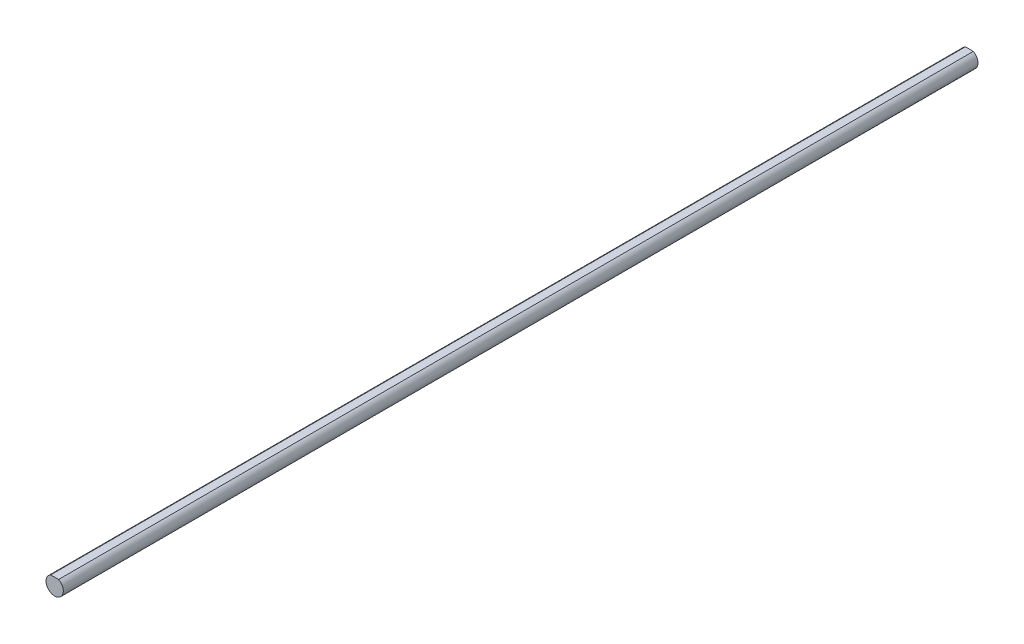
ISO-10303-21;
HEADER;
FILE_DESCRIPTION(('STEP AP214'),'2;1');
FILE_NAME('part.step','',(''),(''),'','','');
FILE_SCHEMA(('AUTOMOTIVE_DESIGN { 1 0 10303 214 1 1 1 1 }'));
ENDSEC;
DATA;
#1=APPLICATION_CONTEXT('core data for automotive mechanical design processes');
#2=APPLICATION_PROTOCOL_DEFINITION('international standard','automotive_design',2000,#1);
#3=PRODUCT_CONTEXT('',#1,'mechanical');
#4=PRODUCT('Part','Part','',(#3));
#5=PRODUCT_RELATED_PRODUCT_CATEGORY('part','',(#4));
#6=PRODUCT_DEFINITION_FORMATION('','',#4);
#7=PRODUCT_DEFINITION_CONTEXT('part definition',#1,'design');
#8=PRODUCT_DEFINITION('design','',#6,#7);
#9=PRODUCT_DEFINITION_SHAPE('','',#8);
#10=(LENGTH_UNIT() NAMED_UNIT(*) SI_UNIT(.MILLI.,.METRE.));
#11=(NAMED_UNIT(*) PLANE_ANGLE_UNIT() SI_UNIT($,.RADIAN.));
#12=(NAMED_UNIT(*) SI_UNIT($,.STERADIAN.) SOLID_ANGLE_UNIT());
#13=UNCERTAINTY_MEASURE_WITH_UNIT(LENGTH_MEASURE(1.E-05),#10,'distance_accuracy_value','');
#14=(GEOMETRIC_REPRESENTATION_CONTEXT(3) GLOBAL_UNCERTAINTY_ASSIGNED_CONTEXT((#13)) GLOBAL_UNIT_ASSIGNED_CONTEXT((#10,
#11,#12)) REPRESENTATION_CONTEXT('',''));
#15=CARTESIAN_POINT('',(0.,0.,0.));
#16=DIRECTION('',(0.,0.,1.));
#17=DIRECTION('',(1.,0.,0.));
#18=AXIS2_PLACEMENT_3D('',#15,#16,#17);
#19=CARTESIAN_POINT('',(0.,0.,125.));
#20=DIRECTION('',(0.,0.,-1.));
#21=DIRECTION('',(-1.,0.,0.));
#22=AXIS2_PLACEMENT_3D('',#19,#20,#21);
#23=CYLINDRICAL_SURFACE('',#22,2.365);
#24=CARTESIAN_POINT('',(0.,0.,-125.));
#25=DIRECTION('',(0.,0.,-1.));
#26=DIRECTION('',(-1.,0.,0.));
#27=AXIS2_PLACEMENT_3D('',#24,#25,#26);
#28=CIRCLE('',#27,2.365);
#29=CARTESIAN_POINT('',(1.0877614628217,2.1,-125.));
#30=VERTEX_POINT('',#29);
#31=CARTESIAN_POINT('',(-1.0877614628217,2.1,-125.));
#32=VERTEX_POINT('',#31);
#33=EDGE_CURVE('E62',#30,#32,#28,.T.);
#34=ORIENTED_EDGE('',*,*,#33,.F.);
#35=DIRECTION('',(0.,0.,-1.));
#36=VECTOR('',#35,1.);
#37=CARTESIAN_POINT('',(1.0877614628217,2.1,125.));
#38=LINE('',#37,#36);
#39=CARTESIAN_POINT('',(1.0877614628217,2.1,125.));
#40=VERTEX_POINT('',#39);
#41=EDGE_CURVE('E11',#40,#30,#38,.T.);
#42=ORIENTED_EDGE('',*,*,#41,.F.);
#43=CARTESIAN_POINT('',(0.,0.,125.));
#44=DIRECTION('',(0.,0.,-1.));
#45=DIRECTION('',(-1.,0.,0.));
#46=AXIS2_PLACEMENT_3D('',#43,#44,#45);
#47=CIRCLE('',#46,2.365);
#48=CARTESIAN_POINT('',(-1.0877614628217,2.1,125.));
#49=VERTEX_POINT('',#48);
#50=EDGE_CURVE('E66',#40,#49,#47,.T.);
#51=ORIENTED_EDGE('',*,*,#50,.T.);
#52=DIRECTION('',(0.,0.,-1.));
#53=VECTOR('',#52,1.);
#54=CARTESIAN_POINT('',(-1.0877614628217,2.1,125.));
#55=LINE('',#54,#53);
#56=EDGE_CURVE('E36',#49,#32,#55,.T.);
#57=ORIENTED_EDGE('',*,*,#56,.T.);
#58=EDGE_LOOP('',(#34,#42,#51,#57));
#59=FACE_BOUND('',#58,.T.);
#60=ADVANCED_FACE('F33',(#59),#23,.T.);
#61=CARTESIAN_POINT('',(-1.0877614628217,2.1,125.));
#62=DIRECTION('',(0.,1.,0.));
#63=DIRECTION('',(0.,0.,1.));
#64=AXIS2_PLACEMENT_3D('',#61,#62,#63);
#65=PLANE('',#64);
#66=DIRECTION('',(1.,0.,0.));
#67=VECTOR('',#66,1.);
#68=CARTESIAN_POINT('',(-1.0877614628217,2.1,-125.));
#69=LINE('',#68,#67);
#70=EDGE_CURVE('E59',#32,#30,#69,.T.);
#71=ORIENTED_EDGE('',*,*,#70,.F.);
#72=ORIENTED_EDGE('',*,*,#56,.F.);
#73=DIRECTION('',(1.,0.,0.));
#74=VECTOR('',#73,1.);
#75=CARTESIAN_POINT('',(-1.0877614628217,2.1,125.));
#76=LINE('',#75,#74);
#77=EDGE_CURVE('E61',#49,#40,#76,.T.);
#78=ORIENTED_EDGE('',*,*,#77,.T.);
#79=ORIENTED_EDGE('',*,*,#41,.T.);
#80=EDGE_LOOP('',(#71,#72,#78,#79));
#81=FACE_BOUND('',#80,.T.);
#82=ADVANCED_FACE('F57',(#81),#65,.T.);
#83=CARTESIAN_POINT('',(0.,0.,125.));
#84=DIRECTION('',(0.,0.,-1.));
#85=DIRECTION('',(-1.,0.,0.));
#86=AXIS2_PLACEMENT_3D('',#83,#84,#85);
#87=PLANE('',#86);
#88=ORIENTED_EDGE('',*,*,#50,.F.);
#89=ORIENTED_EDGE('',*,*,#77,.F.);
#90=EDGE_LOOP('',(#88,#89));
#91=FACE_BOUND('',#90,.T.);
#92=ADVANCED_FACE('F71',(#91),#87,.F.);
#93=CARTESIAN_POINT('',(0.,0.,-125.));
#94=DIRECTION('',(0.,0.,-1.));
#95=DIRECTION('',(-1.,0.,0.));
#96=AXIS2_PLACEMENT_3D('',#93,#94,#95);
#97=PLANE('',#96);
#98=ORIENTED_EDGE('',*,*,#33,.T.);
#99=ORIENTED_EDGE('',*,*,#70,.T.);
#100=EDGE_LOOP('',(#98,#99));
#101=FACE_BOUND('',#100,.T.);
#102=ADVANCED_FACE('F65',(#101),#97,.T.);
#103=CLOSED_SHELL('',(#60,#82,#92,#102));
#104=MANIFOLD_SOLID_BREP('B2',#103);
#105=ADVANCED_BREP_SHAPE_REPRESENTATION('',(#18,#104),#14);
#106=SHAPE_DEFINITION_REPRESENTATION(#9,#105);
ENDSEC;
END-ISO-10303-21;
